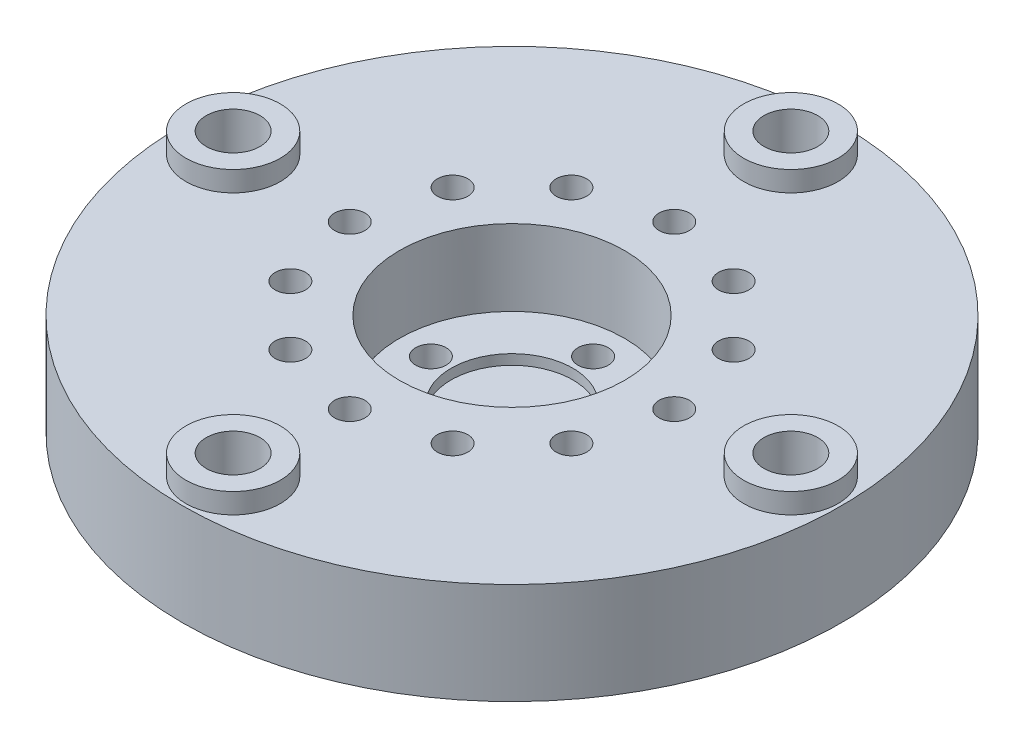
ISO-10303-21;
HEADER;
FILE_DESCRIPTION(('STEP AP214'),'2;1');
FILE_NAME('part.step','',(''),(''),'','','');
FILE_SCHEMA(('AUTOMOTIVE_DESIGN { 1 0 10303 214 1 1 1 1 }'));
ENDSEC;
DATA;
#1=APPLICATION_CONTEXT('core data for automotive mechanical design processes');
#2=APPLICATION_PROTOCOL_DEFINITION('international standard','automotive_design',2000,#1);
#3=PRODUCT_CONTEXT('',#1,'mechanical');
#4=PRODUCT('Part','Part','',(#3));
#5=PRODUCT_RELATED_PRODUCT_CATEGORY('part','',(#4));
#6=PRODUCT_DEFINITION_FORMATION('','',#4);
#7=PRODUCT_DEFINITION_CONTEXT('part definition',#1,'design');
#8=PRODUCT_DEFINITION('design','',#6,#7);
#9=PRODUCT_DEFINITION_SHAPE('','',#8);
#10=(LENGTH_UNIT() NAMED_UNIT(*) SI_UNIT(.MILLI.,.METRE.));
#11=(NAMED_UNIT(*) PLANE_ANGLE_UNIT() SI_UNIT($,.RADIAN.));
#12=(NAMED_UNIT(*) SI_UNIT($,.STERADIAN.) SOLID_ANGLE_UNIT());
#13=UNCERTAINTY_MEASURE_WITH_UNIT(LENGTH_MEASURE(1.E-05),#10,'distance_accuracy_value','');
#14=(GEOMETRIC_REPRESENTATION_CONTEXT(3) GLOBAL_UNCERTAINTY_ASSIGNED_CONTEXT((#13)) GLOBAL_UNIT_ASSIGNED_CONTEXT((#10,
#11,#12)) REPRESENTATION_CONTEXT('',''));
#15=CARTESIAN_POINT('',(0.,0.,0.));
#16=DIRECTION('',(0.,0.,1.));
#17=DIRECTION('',(1.,0.,0.));
#18=AXIS2_PLACEMENT_3D('',#15,#16,#17);
#19=CARTESIAN_POINT('',(0.,3.,0.));
#20=DIRECTION('',(0.,-1.,0.));
#21=DIRECTION('',(0.,0.,-1.));
#22=AXIS2_PLACEMENT_3D('',#19,#20,#21);
#23=CYLINDRICAL_SURFACE('',#22,11.1);
#24=CARTESIAN_POINT('',(0.,3.,0.));
#25=DIRECTION('',(0.,1.,0.));
#26=DIRECTION('',(0.,0.,1.));
#27=AXIS2_PLACEMENT_3D('',#24,#25,#26);
#28=CIRCLE('',#27,11.1);
#29=CARTESIAN_POINT('',(0.,3.,11.1));
#30=VERTEX_POINT('',#29);
#31=EDGE_CURVE('E63',#30,#30,#28,.T.);
#32=ORIENTED_EDGE('',*,*,#31,.T.);
#33=EDGE_LOOP('',(#32));
#34=FACE_BOUND('',#33,.T.);
#35=CARTESIAN_POINT('',(0.,-4.5,0.));
#36=DIRECTION('',(0.,-1.,0.));
#37=DIRECTION('',(0.,0.,-1.));
#38=AXIS2_PLACEMENT_3D('',#35,#36,#37);
#39=CIRCLE('',#38,11.1);
#40=CARTESIAN_POINT('',(0.,-4.5,-11.1));
#41=VERTEX_POINT('',#40);
#42=EDGE_CURVE('E163',#41,#41,#39,.T.);
#43=ORIENTED_EDGE('',*,*,#42,.T.);
#44=EDGE_LOOP('',(#43));
#45=FACE_BOUND('',#44,.T.);
#46=ADVANCED_FACE('F47',(#34,#45),#23,.F.);
#47=CARTESIAN_POINT('',(0.,0.,0.));
#48=DIRECTION('',(0.,1.,0.));
#49=DIRECTION('',(0.,0.,1.));
#50=AXIS2_PLACEMENT_3D('',#47,#48,#49);
#51=PLANE('',#50);
#52=CARTESIAN_POINT('',(0.,0.,-27.5));
#53=DIRECTION('',(0.,1.,0.));
#54=DIRECTION('',(0.,0.,1.));
#55=AXIS2_PLACEMENT_3D('',#52,#53,#54);
#56=CIRCLE('',#55,2.65);
#57=CARTESIAN_POINT('',(0.,0.,-24.85));
#58=VERTEX_POINT('',#57);
#59=EDGE_CURVE('E55',#58,#58,#56,.T.);
#60=ORIENTED_EDGE('',*,*,#59,.T.);
#61=EDGE_LOOP('',(#60));
#62=FACE_BOUND('',#61,.T.);
#63=CARTESIAN_POINT('',(0.,0.,-27.5));
#64=DIRECTION('',(0.,-1.,0.));
#65=DIRECTION('',(0.,0.,-1.));
#66=AXIS2_PLACEMENT_3D('',#63,#64,#65);
#67=CIRCLE('',#66,4.25);
#68=CARTESIAN_POINT('',(0.,0.,-31.75));
#69=VERTEX_POINT('',#68);
#70=EDGE_CURVE('E135',#69,#69,#67,.T.);
#71=ORIENTED_EDGE('',*,*,#70,.T.);
#72=EDGE_LOOP('',(#71));
#73=FACE_BOUND('',#72,.T.);
#74=ADVANCED_FACE('F331',(#62,#73),#51,.F.);
#75=CARTESIAN_POINT('',(-27.4999999999992,0.,7.79913119987283E-13));
#76=DIRECTION('',(0.,1.,0.));
#77=DIRECTION('',(0.,0.,1.));
#78=AXIS2_PLACEMENT_3D('',#75,#76,#77);
#79=CIRCLE('',#78,2.65000000000125);
#80=CARTESIAN_POINT('',(-27.4999999999992,0.,2.65000000000203));
#81=VERTEX_POINT('',#80);
#82=EDGE_CURVE('E80',#81,#81,#79,.T.);
#83=ORIENTED_EDGE('',*,*,#82,.T.);
#84=EDGE_LOOP('',(#83));
#85=FACE_BOUND('',#84,.T.);
#86=CARTESIAN_POINT('',(-27.5000000000008,0.,-7.76545341289627E-13));
#87=DIRECTION('',(0.,-1.,0.));
#88=DIRECTION('',(0.,0.,-1.));
#89=AXIS2_PLACEMENT_3D('',#86,#87,#88);
#90=CIRCLE('',#89,4.25000000000061);
#91=CARTESIAN_POINT('',(-27.5000000000008,0.,-4.25000000000138));
#92=VERTEX_POINT('',#91);
#93=EDGE_CURVE('E143',#92,#92,#90,.T.);
#94=ORIENTED_EDGE('',*,*,#93,.T.);
#95=EDGE_LOOP('',(#94));
#96=FACE_BOUND('',#95,.T.);
#97=ADVANCED_FACE('F336',(#85,#96),#51,.F.);
#98=CARTESIAN_POINT('',(1.55309068257925E-12,0.,27.5));
#99=DIRECTION('',(0.,1.,0.));
#100=DIRECTION('',(0.,0.,1.));
#101=AXIS2_PLACEMENT_3D('',#98,#99,#100);
#102=CIRCLE('',#101,2.65000000000167);
#103=CARTESIAN_POINT('',(1.55309068257925E-12,0.,30.1500000000017));
#104=VERTEX_POINT('',#103);
#105=EDGE_CURVE('E76',#104,#104,#102,.T.);
#106=ORIENTED_EDGE('',*,*,#105,.T.);
#107=EDGE_LOOP('',(#106));
#108=FACE_BOUND('',#107,.T.);
#109=CARTESIAN_POINT('',(-1.55309068257925E-12,0.,27.5));
#110=DIRECTION('',(0.,-1.,0.));
#111=DIRECTION('',(0.,0.,-1.));
#112=AXIS2_PLACEMENT_3D('',#109,#110,#111);
#113=CIRCLE('',#112,4.25000000000167);
#114=CARTESIAN_POINT('',(-1.55309068257925E-12,0.,23.2499999999983));
#115=VERTEX_POINT('',#114);
#116=EDGE_CURVE('E151',#115,#115,#113,.T.);
#117=ORIENTED_EDGE('',*,*,#116,.T.);
#118=EDGE_LOOP('',(#117));
#119=FACE_BOUND('',#118,.T.);
#120=ADVANCED_FACE('F353',(#108,#119),#51,.F.);
#121=CARTESIAN_POINT('',(27.5000000000008,0.,-7.76545341289627E-13));
#122=DIRECTION('',(0.,1.,0.));
#123=DIRECTION('',(0.,0.,1.));
#124=AXIS2_PLACEMENT_3D('',#121,#122,#123);
#125=CIRCLE('',#124,2.65000000000061);
#126=CARTESIAN_POINT('',(27.5000000000008,0.,2.64999999999983));
#127=VERTEX_POINT('',#126);
#128=EDGE_CURVE('E70',#127,#127,#125,.T.);
#129=ORIENTED_EDGE('',*,*,#128,.T.);
#130=EDGE_LOOP('',(#129));
#131=FACE_BOUND('',#130,.T.);
#132=CARTESIAN_POINT('',(27.4999999999992,0.,7.79913119987283E-13));
#133=DIRECTION('',(0.,-1.,0.));
#134=DIRECTION('',(0.,0.,-1.));
#135=AXIS2_PLACEMENT_3D('',#132,#133,#134);
#136=CIRCLE('',#135,4.25000000000125);
#137=CARTESIAN_POINT('',(27.4999999999992,0.,-4.25000000000047));
#138=VERTEX_POINT('',#137);
#139=EDGE_CURVE('E159',#138,#138,#136,.T.);
#140=ORIENTED_EDGE('',*,*,#139,.T.);
#141=EDGE_LOOP('',(#140));
#142=FACE_BOUND('',#141,.T.);
#143=ADVANCED_FACE('F337',(#131,#142),#51,.F.);
#144=CARTESIAN_POINT('',(0.,3.,0.));
#145=DIRECTION('',(0.,1.,0.));
#146=DIRECTION('',(0.,0.,1.));
#147=AXIS2_PLACEMENT_3D('',#144,#145,#146);
#148=PLANE('',#147);
#149=CARTESIAN_POINT('',(-13.85640646055,3.,-8.0000000000006));
#150=DIRECTION('',(0.,1.,0.));
#151=DIRECTION('',(0.,0.,1.));
#152=AXIS2_PLACEMENT_3D('',#149,#150,#151);
#153=CIRCLE('',#152,1.50000000000129);
#154=CARTESIAN_POINT('',(-13.85640646055,3.,-6.4999999999993));
#155=VERTEX_POINT('',#154);
#156=EDGE_CURVE('E199',#155,#155,#153,.T.);
#157=ORIENTED_EDGE('',*,*,#156,.F.);
#158=EDGE_LOOP('',(#157));
#159=FACE_BOUND('',#158,.T.);
#160=CARTESIAN_POINT('',(-7.99999999999873,3.,-13.8564064605514));
#161=DIRECTION('',(0.,1.,0.));
#162=DIRECTION('',(0.,0.,1.));
#163=AXIS2_PLACEMENT_3D('',#160,#161,#162);
#164=CIRCLE('',#163,1.50000000000144);
#165=CARTESIAN_POINT('',(-7.99999999999873,3.,-12.3564064605499));
#166=VERTEX_POINT('',#165);
#167=EDGE_CURVE('E206',#166,#166,#164,.T.);
#168=ORIENTED_EDGE('',*,*,#167,.F.);
#169=EDGE_LOOP('',(#168));
#170=FACE_BOUND('',#169,.T.);
#171=CARTESIAN_POINT('',(1.35836374802349E-12,3.,-16.));
#172=DIRECTION('',(0.,1.,0.));
#173=DIRECTION('',(0.,0.,1.));
#174=AXIS2_PLACEMENT_3D('',#171,#172,#173);
#175=CIRCLE('',#174,1.50000000000141);
#176=CARTESIAN_POINT('',(1.35836374802349E-12,3.,-14.4999999999986));
#177=VERTEX_POINT('',#176);
#178=EDGE_CURVE('E210',#177,#177,#175,.T.);
#179=ORIENTED_EDGE('',*,*,#178,.F.);
#180=EDGE_LOOP('',(#179));
#181=FACE_BOUND('',#180,.T.);
#182=CARTESIAN_POINT('',(8.00000000000127,3.,-13.8564064605507));
#183=DIRECTION('',(0.,1.,0.));
#184=DIRECTION('',(0.,0.,1.));
#185=AXIS2_PLACEMENT_3D('',#182,#183,#184);
#186=CIRCLE('',#185,1.50000000000121);
#187=CARTESIAN_POINT('',(8.00000000000127,3.,-12.3564064605495));
#188=VERTEX_POINT('',#187);
#189=EDGE_CURVE('E214',#188,#188,#186,.T.);
#190=ORIENTED_EDGE('',*,*,#189,.F.);
#191=EDGE_LOOP('',(#190));
#192=FACE_BOUND('',#191,.T.);
#193=CARTESIAN_POINT('',(13.856406460552,3.,-7.99999999999941));
#194=DIRECTION('',(0.,1.,0.));
#195=DIRECTION('',(0.,0.,1.));
#196=AXIS2_PLACEMENT_3D('',#193,#194,#195);
#197=CIRCLE('',#196,1.50000000000088);
#198=CARTESIAN_POINT('',(13.856406460552,3.,-6.49999999999853));
#199=VERTEX_POINT('',#198);
#200=EDGE_CURVE('E218',#199,#199,#197,.T.);
#201=ORIENTED_EDGE('',*,*,#200,.F.);
#202=EDGE_LOOP('',(#201));
#203=FACE_BOUND('',#202,.T.);
#204=CARTESIAN_POINT('',(16.0000000000007,3.,6.79181874011743E-13));
#205=DIRECTION('',(0.,1.,0.));
#206=DIRECTION('',(0.,0.,1.));
#207=AXIS2_PLACEMENT_3D('',#204,#205,#206);
#208=CIRCLE('',#207,1.50000000000051);
#209=CARTESIAN_POINT('',(16.0000000000007,3.,1.50000000000119));
#210=VERTEX_POINT('',#209);
#211=EDGE_CURVE('E222',#210,#210,#208,.T.);
#212=ORIENTED_EDGE('',*,*,#211,.F.);
#213=EDGE_LOOP('',(#212));
#214=FACE_BOUND('',#213,.T.);
#215=CARTESIAN_POINT('',(13.8564064605514,3.,8.00000000000059));
#216=DIRECTION('',(0.,1.,0.));
#217=DIRECTION('',(0.,0.,1.));
#218=AXIS2_PLACEMENT_3D('',#215,#216,#217);
#219=CIRCLE('',#218,1.50000000000019);
#220=CARTESIAN_POINT('',(13.8564064605514,3.,9.50000000000078));
#221=VERTEX_POINT('',#220);
#222=EDGE_CURVE('E226',#221,#221,#219,.T.);
#223=ORIENTED_EDGE('',*,*,#222,.F.);
#224=EDGE_LOOP('',(#223));
#225=FACE_BOUND('',#224,.T.);
#226=CARTESIAN_POINT('',(8.00000000000002,3.,13.856406460551));
#227=DIRECTION('',(0.,1.,0.));
#228=DIRECTION('',(0.,0.,1.));
#229=AXIS2_PLACEMENT_3D('',#226,#227,#228);
#230=CIRCLE('',#229,1.5);
#231=CARTESIAN_POINT('',(8.00000000000002,3.,15.356406460551));
#232=VERTEX_POINT('',#231);
#233=EDGE_CURVE('E230',#232,#232,#230,.T.);
#234=ORIENTED_EDGE('',*,*,#233,.F.);
#235=EDGE_LOOP('',(#234));
#236=FACE_BOUND('',#235,.T.);
#237=CARTESIAN_POINT('',(-15.9999999999993,3.,-6.81141308890378E-13));
#238=DIRECTION('',(0.,1.,0.));
#239=DIRECTION('',(0.,0.,1.));
#240=AXIS2_PLACEMENT_3D('',#237,#238,#239);
#241=CIRCLE('',#240,1.50000000000101);
#242=CARTESIAN_POINT('',(-15.9999999999993,3.,1.50000000000033));
#243=VERTEX_POINT('',#242);
#244=EDGE_CURVE('E234',#243,#243,#241,.T.);
#245=ORIENTED_EDGE('',*,*,#244,.F.);
#246=EDGE_LOOP('',(#245));
#247=FACE_BOUND('',#246,.T.);
#248=CARTESIAN_POINT('',(-13.8564064605507,3.,7.9999999999994));
#249=DIRECTION('',(0.,1.,0.));
#250=DIRECTION('',(0.,0.,1.));
#251=AXIS2_PLACEMENT_3D('',#248,#249,#250);
#252=CIRCLE('',#251,1.50000000000069);
#253=CARTESIAN_POINT('',(-13.8564064605507,3.,9.50000000000009));
#254=VERTEX_POINT('',#253);
#255=EDGE_CURVE('E238',#254,#254,#252,.T.);
#256=ORIENTED_EDGE('',*,*,#255,.F.);
#257=EDGE_LOOP('',(#256));
#258=FACE_BOUND('',#257,.T.);
#259=CARTESIAN_POINT('',(-7.99999999999992,3.,13.8564064605507));
#260=DIRECTION('',(0.,1.,0.));
#261=DIRECTION('',(0.,0.,1.));
#262=AXIS2_PLACEMENT_3D('',#259,#260,#261);
#263=CIRCLE('',#262,1.50000000000039);
#264=CARTESIAN_POINT('',(-7.99999999999992,3.,15.3564064605511));
#265=VERTEX_POINT('',#264);
#266=EDGE_CURVE('E242',#265,#265,#263,.T.);
#267=ORIENTED_EDGE('',*,*,#266,.F.);
#268=EDGE_LOOP('',(#267));
#269=FACE_BOUND('',#268,.T.);
#270=CARTESIAN_POINT('',(0.,3.,16.));
#271=DIRECTION('',(0.,1.,0.));
#272=DIRECTION('',(0.,0.,1.));
#273=AXIS2_PLACEMENT_3D('',#270,#271,#272);
#274=CIRCLE('',#273,1.5);
#275=CARTESIAN_POINT('',(0.,3.,17.5));
#276=VERTEX_POINT('',#275);
#277=EDGE_CURVE('E246',#276,#276,#274,.T.);
#278=ORIENTED_EDGE('',*,*,#277,.F.);
#279=EDGE_LOOP('',(#278));
#280=FACE_BOUND('',#279,.T.);
#281=CARTESIAN_POINT('',(0.,3.,-27.5));
#282=DIRECTION('',(0.,1.,0.));
#283=DIRECTION('',(0.,0.,1.));
#284=AXIS2_PLACEMENT_3D('',#281,#282,#283);
#285=CIRCLE('',#284,4.65);
#286=CARTESIAN_POINT('',(0.,3.,-22.85));
#287=VERTEX_POINT('',#286);
#288=EDGE_CURVE('E111',#287,#287,#285,.T.);
#289=ORIENTED_EDGE('',*,*,#288,.F.);
#290=EDGE_LOOP('',(#289));
#291=FACE_BOUND('',#290,.T.);
#292=CARTESIAN_POINT('',(1.55309068257925E-12,3.,27.5));
#293=DIRECTION('',(0.,1.,0.));
#294=DIRECTION('',(0.,0.,1.));
#295=AXIS2_PLACEMENT_3D('',#292,#293,#294);
#296=CIRCLE('',#295,4.65000000000167);
#297=CARTESIAN_POINT('',(1.55309068257925E-12,3.,32.1500000000017));
#298=VERTEX_POINT('',#297);
#299=EDGE_CURVE('E85',#298,#298,#296,.T.);
#300=ORIENTED_EDGE('',*,*,#299,.F.);
#301=EDGE_LOOP('',(#300));
#302=FACE_BOUND('',#301,.T.);
#303=ORIENTED_EDGE('',*,*,#31,.F.);
#304=EDGE_LOOP('',(#303));
#305=FACE_BOUND('',#304,.T.);
#306=CARTESIAN_POINT('',(0.,3.,0.));
#307=DIRECTION('',(0.,1.,0.));
#308=DIRECTION('',(0.,0.,1.));
#309=AXIS2_PLACEMENT_3D('',#306,#307,#308);
#310=CIRCLE('',#309,32.5);
#311=CARTESIAN_POINT('',(0.,3.,32.5));
#312=VERTEX_POINT('',#311);
#313=EDGE_CURVE('E10',#312,#312,#310,.T.);
#314=ORIENTED_EDGE('',*,*,#313,.T.);
#315=EDGE_LOOP('',(#314));
#316=FACE_BOUND('',#315,.T.);
#317=CARTESIAN_POINT('',(27.5000000000008,3.,-7.76545341289627E-13));
#318=DIRECTION('',(0.,1.,0.));
#319=DIRECTION('',(0.,0.,1.));
#320=AXIS2_PLACEMENT_3D('',#317,#318,#319);
#321=CIRCLE('',#320,4.65000000000061);
#322=CARTESIAN_POINT('',(27.5000000000008,3.,4.64999999999983));
#323=VERTEX_POINT('',#322);
#324=EDGE_CURVE('E99',#323,#323,#321,.T.);
#325=ORIENTED_EDGE('',*,*,#324,.F.);
#326=EDGE_LOOP('',(#325));
#327=FACE_BOUND('',#326,.T.);
#328=CARTESIAN_POINT('',(-27.4999999999992,3.,7.79913119987283E-13));
#329=DIRECTION('',(0.,1.,0.));
#330=DIRECTION('',(0.,0.,1.));
#331=AXIS2_PLACEMENT_3D('',#328,#329,#330);
#332=CIRCLE('',#331,4.65000000000125);
#333=CARTESIAN_POINT('',(-27.4999999999992,3.,4.65000000000203));
#334=VERTEX_POINT('',#333);
#335=EDGE_CURVE('E122',#334,#334,#332,.T.);
#336=ORIENTED_EDGE('',*,*,#335,.F.);
#337=EDGE_LOOP('',(#336));
#338=FACE_BOUND('',#337,.T.);
#339=ADVANCED_FACE('F346',(#159,#170,#181,#192,#203,#214,#225,#236,#247,#258,#269,#280,#291,
#302,#305,#316,#327,#338),#148,.T.);
#340=CARTESIAN_POINT('',(0.,3.,0.));
#341=DIRECTION('',(0.,-1.,0.));
#342=DIRECTION('',(0.,0.,-1.));
#343=AXIS2_PLACEMENT_3D('',#340,#341,#342);
#344=CYLINDRICAL_SURFACE('',#343,32.5);
#345=ORIENTED_EDGE('',*,*,#313,.F.);
#346=EDGE_LOOP('',(#345));
#347=FACE_BOUND('',#346,.T.);
#348=CARTESIAN_POINT('',(0.,-7.,0.));
#349=DIRECTION('',(0.,-1.,0.));
#350=DIRECTION('',(0.,0.,-1.));
#351=AXIS2_PLACEMENT_3D('',#348,#349,#350);
#352=CIRCLE('',#351,32.5);
#353=CARTESIAN_POINT('',(0.,-7.,-32.5));
#354=VERTEX_POINT('',#353);
#355=EDGE_CURVE('E127',#354,#354,#352,.T.);
#356=ORIENTED_EDGE('',*,*,#355,.F.);
#357=EDGE_LOOP('',(#356));
#358=FACE_BOUND('',#357,.T.);
#359=ADVANCED_FACE('F49',(#347,#358),#344,.T.);
#360=CARTESIAN_POINT('',(0.,3.,-27.5));
#361=DIRECTION('',(0.,-1.,0.));
#362=DIRECTION('',(0.,0.,-1.));
#363=AXIS2_PLACEMENT_3D('',#360,#361,#362);
#364=CYLINDRICAL_SURFACE('',#363,2.65);
#365=ORIENTED_EDGE('',*,*,#59,.F.);
#366=EDGE_LOOP('',(#365));
#367=FACE_BOUND('',#366,.T.);
#368=CARTESIAN_POINT('',(0.,5.,-27.5));
#369=DIRECTION('',(0.,1.,0.));
#370=DIRECTION('',(0.,0.,1.));
#371=AXIS2_PLACEMENT_3D('',#368,#369,#370);
#372=CIRCLE('',#371,2.65);
#373=CARTESIAN_POINT('',(0.,5.,-24.85));
#374=VERTEX_POINT('',#373);
#375=EDGE_CURVE('E104',#374,#374,#372,.T.);
#376=ORIENTED_EDGE('',*,*,#375,.T.);
#377=EDGE_LOOP('',(#376));
#378=FACE_BOUND('',#377,.T.);
#379=ADVANCED_FACE('F342',(#367,#378),#364,.F.);
#380=CARTESIAN_POINT('',(27.5000000000008,3.,-7.76545341289627E-13));
#381=DIRECTION('',(0.,-1.,0.));
#382=DIRECTION('',(0.,0.,-1.));
#383=AXIS2_PLACEMENT_3D('',#380,#381,#382);
#384=CYLINDRICAL_SURFACE('',#383,2.65000000000061);
#385=ORIENTED_EDGE('',*,*,#128,.F.);
#386=EDGE_LOOP('',(#385));
#387=FACE_BOUND('',#386,.T.);
#388=CARTESIAN_POINT('',(27.5000000000008,5.,-7.76545341289627E-13));
#389=DIRECTION('',(0.,1.,0.));
#390=DIRECTION('',(0.,0.,1.));
#391=AXIS2_PLACEMENT_3D('',#388,#389,#390);
#392=CIRCLE('',#391,2.65000000000061);
#393=CARTESIAN_POINT('',(27.5000000000008,5.,2.64999999999983));
#394=VERTEX_POINT('',#393);
#395=EDGE_CURVE('E95',#394,#394,#392,.T.);
#396=ORIENTED_EDGE('',*,*,#395,.T.);
#397=EDGE_LOOP('',(#396));
#398=FACE_BOUND('',#397,.T.);
#399=ADVANCED_FACE('F340',(#387,#398),#384,.F.);
#400=CARTESIAN_POINT('',(1.55309068257925E-12,3.,27.5));
#401=DIRECTION('',(0.,-1.,0.));
#402=DIRECTION('',(0.,0.,-1.));
#403=AXIS2_PLACEMENT_3D('',#400,#401,#402);
#404=CYLINDRICAL_SURFACE('',#403,2.65000000000167);
#405=ORIENTED_EDGE('',*,*,#105,.F.);
#406=EDGE_LOOP('',(#405));
#407=FACE_BOUND('',#406,.T.);
#408=CARTESIAN_POINT('',(1.55309068257925E-12,5.,27.5));
#409=DIRECTION('',(0.,1.,0.));
#410=DIRECTION('',(0.,0.,1.));
#411=AXIS2_PLACEMENT_3D('',#408,#409,#410);
#412=CIRCLE('',#411,2.65000000000167);
#413=CARTESIAN_POINT('',(1.55309068257925E-12,5.,30.1500000000017));
#414=VERTEX_POINT('',#413);
#415=EDGE_CURVE('E88',#414,#414,#412,.T.);
#416=ORIENTED_EDGE('',*,*,#415,.T.);
#417=EDGE_LOOP('',(#416));
#418=FACE_BOUND('',#417,.T.);
#419=ADVANCED_FACE('F432',(#407,#418),#404,.F.);
#420=CARTESIAN_POINT('',(-27.4999999999992,3.,7.79913119987283E-13));
#421=DIRECTION('',(0.,-1.,0.));
#422=DIRECTION('',(0.,0.,-1.));
#423=AXIS2_PLACEMENT_3D('',#420,#421,#422);
#424=CYLINDRICAL_SURFACE('',#423,2.65000000000125);
#425=ORIENTED_EDGE('',*,*,#82,.F.);
#426=EDGE_LOOP('',(#425));
#427=FACE_BOUND('',#426,.T.);
#428=CARTESIAN_POINT('',(-27.4999999999992,5.,7.79913119987283E-13));
#429=DIRECTION('',(0.,1.,0.));
#430=DIRECTION('',(0.,0.,1.));
#431=AXIS2_PLACEMENT_3D('',#428,#429,#430);
#432=CIRCLE('',#431,2.65000000000125);
#433=CARTESIAN_POINT('',(-27.4999999999992,5.,2.65000000000203));
#434=VERTEX_POINT('',#433);
#435=EDGE_CURVE('E116',#434,#434,#432,.T.);
#436=ORIENTED_EDGE('',*,*,#435,.T.);
#437=EDGE_LOOP('',(#436));
#438=FACE_BOUND('',#437,.T.);
#439=ADVANCED_FACE('F426',(#427,#438),#424,.F.);
#440=CARTESIAN_POINT('',(1.55309068257925E-12,5.,27.5));
#441=DIRECTION('',(0.,1.,0.));
#442=DIRECTION('',(0.,0.,1.));
#443=AXIS2_PLACEMENT_3D('',#440,#441,#442);
#444=PLANE('',#443);
#445=CARTESIAN_POINT('',(1.55309068257925E-12,5.,27.5));
#446=DIRECTION('',(0.,1.,0.));
#447=DIRECTION('',(0.,0.,1.));
#448=AXIS2_PLACEMENT_3D('',#445,#446,#447);
#449=CIRCLE('',#448,4.65000000000167);
#450=CARTESIAN_POINT('',(1.55309068257925E-12,5.,32.1500000000017));
#451=VERTEX_POINT('',#450);
#452=EDGE_CURVE('E84',#451,#451,#449,.T.);
#453=ORIENTED_EDGE('',*,*,#452,.T.);
#454=EDGE_LOOP('',(#453));
#455=FACE_BOUND('',#454,.T.);
#456=ORIENTED_EDGE('',*,*,#415,.F.);
#457=EDGE_LOOP('',(#456));
#458=FACE_BOUND('',#457,.T.);
#459=ADVANCED_FACE('F423',(#455,#458),#444,.T.);
#460=CARTESIAN_POINT('',(1.55309068257925E-12,5.,27.5));
#461=DIRECTION('',(0.,-1.,0.));
#462=DIRECTION('',(0.,0.,-1.));
#463=AXIS2_PLACEMENT_3D('',#460,#461,#462);
#464=CYLINDRICAL_SURFACE('',#463,4.65000000000167);
#465=ORIENTED_EDGE('',*,*,#452,.F.);
#466=EDGE_LOOP('',(#465));
#467=FACE_BOUND('',#466,.T.);
#468=ORIENTED_EDGE('',*,*,#299,.T.);
#469=EDGE_LOOP('',(#468));
#470=FACE_BOUND('',#469,.T.);
#471=ADVANCED_FACE('F421',(#467,#470),#464,.T.);
#472=CARTESIAN_POINT('',(27.5000000000008,5.,-7.76545341289627E-13));
#473=DIRECTION('',(0.,1.,0.));
#474=DIRECTION('',(0.,0.,1.));
#475=AXIS2_PLACEMENT_3D('',#472,#473,#474);
#476=PLANE('',#475);
#477=CARTESIAN_POINT('',(27.5000000000008,5.,-7.76545341289627E-13));
#478=DIRECTION('',(0.,1.,0.));
#479=DIRECTION('',(0.,0.,1.));
#480=AXIS2_PLACEMENT_3D('',#477,#478,#479);
#481=CIRCLE('',#480,4.65000000000061);
#482=CARTESIAN_POINT('',(27.5000000000008,5.,4.64999999999983));
#483=VERTEX_POINT('',#482);
#484=EDGE_CURVE('E100',#483,#483,#481,.T.);
#485=ORIENTED_EDGE('',*,*,#484,.T.);
#486=EDGE_LOOP('',(#485));
#487=FACE_BOUND('',#486,.T.);
#488=ORIENTED_EDGE('',*,*,#395,.F.);
#489=EDGE_LOOP('',(#488));
#490=FACE_BOUND('',#489,.T.);
#491=ADVANCED_FACE('F417',(#487,#490),#476,.T.);
#492=CARTESIAN_POINT('',(27.5000000000008,5.,-7.76545341289627E-13));
#493=DIRECTION('',(0.,-1.,0.));
#494=DIRECTION('',(0.,0.,-1.));
#495=AXIS2_PLACEMENT_3D('',#492,#493,#494);
#496=CYLINDRICAL_SURFACE('',#495,4.65000000000061);
#497=ORIENTED_EDGE('',*,*,#484,.F.);
#498=EDGE_LOOP('',(#497));
#499=FACE_BOUND('',#498,.T.);
#500=ORIENTED_EDGE('',*,*,#324,.T.);
#501=EDGE_LOOP('',(#500));
#502=FACE_BOUND('',#501,.T.);
#503=ADVANCED_FACE('F413',(#499,#502),#496,.T.);
#504=CARTESIAN_POINT('',(0.,5.,-27.5));
#505=DIRECTION('',(0.,1.,0.));
#506=DIRECTION('',(0.,0.,1.));
#507=AXIS2_PLACEMENT_3D('',#504,#505,#506);
#508=PLANE('',#507);
#509=CARTESIAN_POINT('',(0.,5.,-27.5));
#510=DIRECTION('',(0.,1.,0.));
#511=DIRECTION('',(0.,0.,1.));
#512=AXIS2_PLACEMENT_3D('',#509,#510,#511);
#513=CIRCLE('',#512,4.65);
#514=CARTESIAN_POINT('',(0.,5.,-22.85));
#515=VERTEX_POINT('',#514);
#516=EDGE_CURVE('E112',#515,#515,#513,.T.);
#517=ORIENTED_EDGE('',*,*,#516,.T.);
#518=EDGE_LOOP('',(#517));
#519=FACE_BOUND('',#518,.T.);
#520=ORIENTED_EDGE('',*,*,#375,.F.);
#521=EDGE_LOOP('',(#520));
#522=FACE_BOUND('',#521,.T.);
#523=ADVANCED_FACE('F409',(#519,#522),#508,.T.);
#524=CARTESIAN_POINT('',(0.,5.,-27.5));
#525=DIRECTION('',(0.,-1.,0.));
#526=DIRECTION('',(0.,0.,-1.));
#527=AXIS2_PLACEMENT_3D('',#524,#525,#526);
#528=CYLINDRICAL_SURFACE('',#527,4.65);
#529=ORIENTED_EDGE('',*,*,#516,.F.);
#530=EDGE_LOOP('',(#529));
#531=FACE_BOUND('',#530,.T.);
#532=ORIENTED_EDGE('',*,*,#288,.T.);
#533=EDGE_LOOP('',(#532));
#534=FACE_BOUND('',#533,.T.);
#535=ADVANCED_FACE('F401',(#531,#534),#528,.T.);
#536=CARTESIAN_POINT('',(-27.4999999999992,5.,7.79913119987283E-13));
#537=DIRECTION('',(0.,1.,0.));
#538=DIRECTION('',(0.,0.,1.));
#539=AXIS2_PLACEMENT_3D('',#536,#537,#538);
#540=PLANE('',#539);
#541=CARTESIAN_POINT('',(-27.4999999999992,5.,7.79913119987283E-13));
#542=DIRECTION('',(0.,1.,0.));
#543=DIRECTION('',(0.,0.,1.));
#544=AXIS2_PLACEMENT_3D('',#541,#542,#543);
#545=CIRCLE('',#544,4.65000000000125);
#546=CARTESIAN_POINT('',(-27.4999999999992,5.,4.65000000000203));
#547=VERTEX_POINT('',#546);
#548=EDGE_CURVE('E123',#547,#547,#545,.T.);
#549=ORIENTED_EDGE('',*,*,#548,.T.);
#550=EDGE_LOOP('',(#549));
#551=FACE_BOUND('',#550,.T.);
#552=ORIENTED_EDGE('',*,*,#435,.F.);
#553=EDGE_LOOP('',(#552));
#554=FACE_BOUND('',#553,.T.);
#555=ADVANCED_FACE('F392',(#551,#554),#540,.T.);
#556=CARTESIAN_POINT('',(-27.4999999999992,5.,7.79913119987283E-13));
#557=DIRECTION('',(0.,-1.,0.));
#558=DIRECTION('',(0.,0.,-1.));
#559=AXIS2_PLACEMENT_3D('',#556,#557,#558);
#560=CYLINDRICAL_SURFACE('',#559,4.65000000000125);
#561=ORIENTED_EDGE('',*,*,#548,.F.);
#562=EDGE_LOOP('',(#561));
#563=FACE_BOUND('',#562,.T.);
#564=ORIENTED_EDGE('',*,*,#335,.T.);
#565=EDGE_LOOP('',(#564));
#566=FACE_BOUND('',#565,.T.);
#567=ADVANCED_FACE('F389',(#563,#566),#560,.T.);
#568=CARTESIAN_POINT('',(0.,-7.,0.));
#569=DIRECTION('',(0.,-1.,0.));
#570=DIRECTION('',(0.,0.,-1.));
#571=AXIS2_PLACEMENT_3D('',#568,#569,#570);
#572=PLANE('',#571);
#573=CARTESIAN_POINT('',(-13.85640646055,-7.,-8.0000000000006));
#574=DIRECTION('',(0.,-1.,0.));
#575=DIRECTION('',(0.,0.,-1.));
#576=AXIS2_PLACEMENT_3D('',#573,#574,#575);
#577=CIRCLE('',#576,1.50000000000129);
#578=CARTESIAN_POINT('',(-13.85640646055,-7.,-9.50000000000189));
#579=VERTEX_POINT('',#578);
#580=EDGE_CURVE('E269',#579,#579,#577,.T.);
#581=ORIENTED_EDGE('',*,*,#580,.F.);
#582=EDGE_LOOP('',(#581));
#583=FACE_BOUND('',#582,.T.);
#584=CARTESIAN_POINT('',(-7.99999999999873,-7.,-13.8564064605514));
#585=DIRECTION('',(0.,-1.,0.));
#586=DIRECTION('',(0.,0.,-1.));
#587=AXIS2_PLACEMENT_3D('',#584,#585,#586);
#588=CIRCLE('',#587,1.50000000000144);
#589=CARTESIAN_POINT('',(-7.99999999999873,-7.,-15.3564064605528));
#590=VERTEX_POINT('',#589);
#591=EDGE_CURVE('E273',#590,#590,#588,.T.);
#592=ORIENTED_EDGE('',*,*,#591,.F.);
#593=EDGE_LOOP('',(#592));
#594=FACE_BOUND('',#593,.T.);
#595=CARTESIAN_POINT('',(1.35836374802349E-12,-7.,-16.));
#596=DIRECTION('',(0.,-1.,0.));
#597=DIRECTION('',(0.,0.,-1.));
#598=AXIS2_PLACEMENT_3D('',#595,#596,#597);
#599=CIRCLE('',#598,1.50000000000141);
#600=CARTESIAN_POINT('',(1.35836374802349E-12,-7.,-17.5000000000014));
#601=VERTEX_POINT('',#600);
#602=EDGE_CURVE('E278',#601,#601,#599,.T.);
#603=ORIENTED_EDGE('',*,*,#602,.F.);
#604=EDGE_LOOP('',(#603));
#605=FACE_BOUND('',#604,.T.);
#606=CARTESIAN_POINT('',(8.00000000000127,-7.,-13.8564064605507));
#607=DIRECTION('',(0.,-1.,0.));
#608=DIRECTION('',(0.,0.,-1.));
#609=AXIS2_PLACEMENT_3D('',#606,#607,#608);
#610=CIRCLE('',#609,1.50000000000121);
#611=CARTESIAN_POINT('',(8.00000000000127,-7.,-15.3564064605519));
#612=VERTEX_POINT('',#611);
#613=EDGE_CURVE('E258',#612,#612,#610,.T.);
#614=ORIENTED_EDGE('',*,*,#613,.F.);
#615=EDGE_LOOP('',(#614));
#616=FACE_BOUND('',#615,.T.);
#617=CARTESIAN_POINT('',(13.856406460552,-7.,-7.99999999999941));
#618=DIRECTION('',(0.,-1.,0.));
#619=DIRECTION('',(0.,0.,-1.));
#620=AXIS2_PLACEMENT_3D('',#617,#618,#619);
#621=CIRCLE('',#620,1.50000000000088);
#622=CARTESIAN_POINT('',(13.856406460552,-7.,-9.50000000000029));
#623=VERTEX_POINT('',#622);
#624=EDGE_CURVE('E254',#623,#623,#621,.T.);
#625=ORIENTED_EDGE('',*,*,#624,.F.);
#626=EDGE_LOOP('',(#625));
#627=FACE_BOUND('',#626,.T.);
#628=CARTESIAN_POINT('',(16.0000000000007,-7.,6.79181874011743E-13));
#629=DIRECTION('',(0.,-1.,0.));
#630=DIRECTION('',(0.,0.,-1.));
#631=AXIS2_PLACEMENT_3D('',#628,#629,#630);
#632=CIRCLE('',#631,1.50000000000051);
#633=CARTESIAN_POINT('',(16.0000000000007,-7.,-1.49999999999983));
#634=VERTEX_POINT('',#633);
#635=EDGE_CURVE('E257',#634,#634,#632,.T.);
#636=ORIENTED_EDGE('',*,*,#635,.F.);
#637=EDGE_LOOP('',(#636));
#638=FACE_BOUND('',#637,.T.);
#639=CARTESIAN_POINT('',(13.8564064605514,-7.,8.00000000000059));
#640=DIRECTION('',(0.,-1.,0.));
#641=DIRECTION('',(0.,0.,-1.));
#642=AXIS2_PLACEMENT_3D('',#639,#640,#641);
#643=CIRCLE('',#642,1.50000000000019);
#644=CARTESIAN_POINT('',(13.8564064605514,-7.,6.5000000000004));
#645=VERTEX_POINT('',#644);
#646=EDGE_CURVE('E262',#645,#645,#643,.T.);
#647=ORIENTED_EDGE('',*,*,#646,.F.);
#648=EDGE_LOOP('',(#647));
#649=FACE_BOUND('',#648,.T.);
#650=CARTESIAN_POINT('',(8.00000000000002,-7.,13.856406460551));
#651=DIRECTION('',(0.,-1.,0.));
#652=DIRECTION('',(0.,0.,-1.));
#653=AXIS2_PLACEMENT_3D('',#650,#651,#652);
#654=CIRCLE('',#653,1.5);
#655=CARTESIAN_POINT('',(8.00000000000002,-7.,12.356406460551));
#656=VERTEX_POINT('',#655);
#657=EDGE_CURVE('E253',#656,#656,#654,.T.);
#658=ORIENTED_EDGE('',*,*,#657,.F.);
#659=EDGE_LOOP('',(#658));
#660=FACE_BOUND('',#659,.T.);
#661=CARTESIAN_POINT('',(-15.9999999999993,-7.,-6.81141308890378E-13));
#662=DIRECTION('',(0.,-1.,0.));
#663=DIRECTION('',(0.,0.,-1.));
#664=AXIS2_PLACEMENT_3D('',#661,#662,#663);
#665=CIRCLE('',#664,1.50000000000101);
#666=CARTESIAN_POINT('',(-15.9999999999993,-7.,-1.50000000000169));
#667=VERTEX_POINT('',#666);
#668=EDGE_CURVE('E274',#667,#667,#665,.T.);
#669=ORIENTED_EDGE('',*,*,#668,.F.);
#670=EDGE_LOOP('',(#669));
#671=FACE_BOUND('',#670,.T.);
#672=CARTESIAN_POINT('',(-13.8564064605507,-7.,7.9999999999994));
#673=DIRECTION('',(0.,-1.,0.));
#674=DIRECTION('',(0.,0.,-1.));
#675=AXIS2_PLACEMENT_3D('',#672,#673,#674);
#676=CIRCLE('',#675,1.50000000000069);
#677=CARTESIAN_POINT('',(-13.8564064605507,-7.,6.49999999999871));
#678=VERTEX_POINT('',#677);
#679=EDGE_CURVE('E289',#678,#678,#676,.T.);
#680=ORIENTED_EDGE('',*,*,#679,.F.);
#681=EDGE_LOOP('',(#680));
#682=FACE_BOUND('',#681,.T.);
#683=CARTESIAN_POINT('',(-7.99999999999992,-7.,13.8564064605507));
#684=DIRECTION('',(0.,-1.,0.));
#685=DIRECTION('',(0.,0.,-1.));
#686=AXIS2_PLACEMENT_3D('',#683,#684,#685);
#687=CIRCLE('',#686,1.50000000000039);
#688=CARTESIAN_POINT('',(-7.99999999999992,-7.,12.3564064605503));
#689=VERTEX_POINT('',#688);
#690=EDGE_CURVE('E285',#689,#689,#687,.T.);
#691=ORIENTED_EDGE('',*,*,#690,.F.);
#692=EDGE_LOOP('',(#691));
#693=FACE_BOUND('',#692,.T.);
#694=CARTESIAN_POINT('',(0.,-7.,16.));
#695=DIRECTION('',(0.,-1.,0.));
#696=DIRECTION('',(0.,0.,-1.));
#697=AXIS2_PLACEMENT_3D('',#694,#695,#696);
#698=CIRCLE('',#697,1.5);
#699=CARTESIAN_POINT('',(0.,-7.,14.5));
#700=VERTEX_POINT('',#699);
#701=EDGE_CURVE('E250',#700,#700,#698,.T.);
#702=ORIENTED_EDGE('',*,*,#701,.F.);
#703=EDGE_LOOP('',(#702));
#704=FACE_BOUND('',#703,.T.);
#705=CARTESIAN_POINT('',(-1.55309068257925E-12,-7.,27.5));
#706=DIRECTION('',(0.,-1.,0.));
#707=DIRECTION('',(0.,0.,-1.));
#708=AXIS2_PLACEMENT_3D('',#705,#706,#707);
#709=CIRCLE('',#708,4.25000000000167);
#710=CARTESIAN_POINT('',(-1.55309068257925E-12,-7.,23.2499999999983));
#711=VERTEX_POINT('',#710);
#712=EDGE_CURVE('E147',#711,#711,#709,.T.);
#713=ORIENTED_EDGE('',*,*,#712,.F.);
#714=EDGE_LOOP('',(#713));
#715=FACE_BOUND('',#714,.T.);
#716=CARTESIAN_POINT('',(0.,-7.,-27.5));
#717=DIRECTION('',(0.,-1.,0.));
#718=DIRECTION('',(0.,0.,-1.));
#719=AXIS2_PLACEMENT_3D('',#716,#717,#718);
#720=CIRCLE('',#719,4.25);
#721=CARTESIAN_POINT('',(0.,-7.,-31.75));
#722=VERTEX_POINT('',#721);
#723=EDGE_CURVE('E134',#722,#722,#720,.T.);
#724=ORIENTED_EDGE('',*,*,#723,.F.);
#725=EDGE_LOOP('',(#724));
#726=FACE_BOUND('',#725,.T.);
#727=ORIENTED_EDGE('',*,*,#355,.T.);
#728=EDGE_LOOP('',(#727));
#729=FACE_BOUND('',#728,.T.);
#730=CARTESIAN_POINT('',(-27.5000000000008,-7.,-7.76545341289627E-13));
#731=DIRECTION('',(0.,-1.,0.));
#732=DIRECTION('',(0.,0.,-1.));
#733=AXIS2_PLACEMENT_3D('',#730,#731,#732);
#734=CIRCLE('',#733,4.25000000000061);
#735=CARTESIAN_POINT('',(-27.5000000000008,-7.,-4.25000000000138));
#736=VERTEX_POINT('',#735);
#737=EDGE_CURVE('E139',#736,#736,#734,.T.);
#738=ORIENTED_EDGE('',*,*,#737,.F.);
#739=EDGE_LOOP('',(#738));
#740=FACE_BOUND('',#739,.T.);
#741=CARTESIAN_POINT('',(27.4999999999992,-7.,7.79913119987283E-13));
#742=DIRECTION('',(0.,-1.,0.));
#743=DIRECTION('',(0.,0.,-1.));
#744=AXIS2_PLACEMENT_3D('',#741,#742,#743);
#745=CIRCLE('',#744,4.25000000000125);
#746=CARTESIAN_POINT('',(27.4999999999992,-7.,-4.25000000000047));
#747=VERTEX_POINT('',#746);
#748=EDGE_CURVE('E155',#747,#747,#745,.T.);
#749=ORIENTED_EDGE('',*,*,#748,.F.);
#750=EDGE_LOOP('',(#749));
#751=FACE_BOUND('',#750,.T.);
#752=CARTESIAN_POINT('',(7.99999999999977,-7.,2.26883816723573E-13));
#753=DIRECTION('',(0.,-1.,0.));
#754=DIRECTION('',(0.,0.,-1.));
#755=AXIS2_PLACEMENT_3D('',#752,#753,#754);
#756=CIRCLE('',#755,1.50000000000036);
#757=CARTESIAN_POINT('',(7.99999999999977,-7.,-1.50000000000014));
#758=VERTEX_POINT('',#757);
#759=EDGE_CURVE('E195',#758,#758,#756,.T.);
#760=ORIENTED_EDGE('',*,*,#759,.F.);
#761=EDGE_LOOP('',(#760));
#762=FACE_BOUND('',#761,.T.);
#763=CARTESIAN_POINT('',(-4.51808198568511E-13,-7.,8.));
#764=DIRECTION('',(0.,-1.,0.));
#765=DIRECTION('',(0.,0.,-1.));
#766=AXIS2_PLACEMENT_3D('',#763,#764,#765);
#767=CIRCLE('',#766,1.50000000000049);
#768=CARTESIAN_POINT('',(-4.51808198568511E-13,-7.,6.49999999999952));
#769=VERTEX_POINT('',#768);
#770=EDGE_CURVE('E187',#769,#769,#767,.T.);
#771=ORIENTED_EDGE('',*,*,#770,.F.);
#772=EDGE_LOOP('',(#771));
#773=FACE_BOUND('',#772,.T.);
#774=CARTESIAN_POINT('',(-8.00000000000023,-7.,-2.25904099284255E-13));
#775=DIRECTION('',(0.,-1.,0.));
#776=DIRECTION('',(0.,0.,-1.));
#777=AXIS2_PLACEMENT_3D('',#774,#775,#776);
#778=CIRCLE('',#777,1.50000000000018);
#779=CARTESIAN_POINT('',(-8.00000000000023,-7.,-1.5000000000004));
#780=VERTEX_POINT('',#779);
#781=EDGE_CURVE('E179',#780,#780,#778,.T.);
#782=ORIENTED_EDGE('',*,*,#781,.F.);
#783=EDGE_LOOP('',(#782));
#784=FACE_BOUND('',#783,.T.);
#785=CARTESIAN_POINT('',(0.,-7.,-8.));
#786=DIRECTION('',(0.,-1.,0.));
#787=DIRECTION('',(0.,0.,-1.));
#788=AXIS2_PLACEMENT_3D('',#785,#786,#787);
#789=CIRCLE('',#788,1.5);
#790=CARTESIAN_POINT('',(0.,-7.,-9.5));
#791=VERTEX_POINT('',#790);
#792=EDGE_CURVE('E171',#791,#791,#789,.T.);
#793=ORIENTED_EDGE('',*,*,#792,.F.);
#794=EDGE_LOOP('',(#793));
#795=FACE_BOUND('',#794,.T.);
#796=ADVANCED_FACE('F391',(#583,#594,#605,#616,#627,#638,#649,#660,#671,#682,#693,#704,#715,
#726,#729,#740,#751,#762,#773,#784,#795),#572,.T.);
#797=CARTESIAN_POINT('',(0.,-7.,-27.5));
#798=DIRECTION('',(0.,1.,0.));
#799=DIRECTION('',(0.,0.,1.));
#800=AXIS2_PLACEMENT_3D('',#797,#798,#799);
#801=CYLINDRICAL_SURFACE('',#800,4.25);
#802=ORIENTED_EDGE('',*,*,#723,.T.);
#803=EDGE_LOOP('',(#802));
#804=FACE_BOUND('',#803,.T.);
#805=ORIENTED_EDGE('',*,*,#70,.F.);
#806=EDGE_LOOP('',(#805));
#807=FACE_BOUND('',#806,.T.);
#808=ADVANCED_FACE('F398',(#804,#807),#801,.F.);
#809=CARTESIAN_POINT('',(-27.5000000000008,-7.,-7.76545341289627E-13));
#810=DIRECTION('',(0.,1.,0.));
#811=DIRECTION('',(0.,0.,1.));
#812=AXIS2_PLACEMENT_3D('',#809,#810,#811);
#813=CYLINDRICAL_SURFACE('',#812,4.25000000000061);
#814=ORIENTED_EDGE('',*,*,#737,.T.);
#815=EDGE_LOOP('',(#814));
#816=FACE_BOUND('',#815,.T.);
#817=ORIENTED_EDGE('',*,*,#93,.F.);
#818=EDGE_LOOP('',(#817));
#819=FACE_BOUND('',#818,.T.);
#820=ADVANCED_FACE('F450',(#816,#819),#813,.F.);
#821=CARTESIAN_POINT('',(-1.55309068257925E-12,-7.,27.5));
#822=DIRECTION('',(0.,1.,0.));
#823=DIRECTION('',(0.,0.,1.));
#824=AXIS2_PLACEMENT_3D('',#821,#822,#823);
#825=CYLINDRICAL_SURFACE('',#824,4.25000000000167);
#826=ORIENTED_EDGE('',*,*,#712,.T.);
#827=EDGE_LOOP('',(#826));
#828=FACE_BOUND('',#827,.T.);
#829=ORIENTED_EDGE('',*,*,#116,.F.);
#830=EDGE_LOOP('',(#829));
#831=FACE_BOUND('',#830,.T.);
#832=ADVANCED_FACE('F448',(#828,#831),#825,.F.);
#833=CARTESIAN_POINT('',(27.4999999999992,-7.,7.79913119987283E-13));
#834=DIRECTION('',(0.,1.,0.));
#835=DIRECTION('',(0.,0.,1.));
#836=AXIS2_PLACEMENT_3D('',#833,#834,#835);
#837=CYLINDRICAL_SURFACE('',#836,4.25000000000125);
#838=ORIENTED_EDGE('',*,*,#748,.T.);
#839=EDGE_LOOP('',(#838));
#840=FACE_BOUND('',#839,.T.);
#841=ORIENTED_EDGE('',*,*,#139,.F.);
#842=EDGE_LOOP('',(#841));
#843=FACE_BOUND('',#842,.T.);
#844=ADVANCED_FACE('F318',(#840,#843),#837,.F.);
#845=CARTESIAN_POINT('',(0.,-4.5,0.));
#846=DIRECTION('',(0.,-1.,0.));
#847=DIRECTION('',(0.,0.,-1.));
#848=AXIS2_PLACEMENT_3D('',#845,#846,#847);
#849=PLANE('',#848);
#850=CARTESIAN_POINT('',(0.,-4.5,0.));
#851=DIRECTION('',(0.,1.,0.));
#852=DIRECTION('',(0.,0.,1.));
#853=AXIS2_PLACEMENT_3D('',#850,#851,#852);
#854=CIRCLE('',#853,6.);
#855=CARTESIAN_POINT('',(0.,-4.5,6.));
#856=VERTEX_POINT('',#855);
#857=EDGE_CURVE('E297',#856,#856,#854,.T.);
#858=ORIENTED_EDGE('',*,*,#857,.F.);
#859=EDGE_LOOP('',(#858));
#860=FACE_BOUND('',#859,.T.);
#861=CARTESIAN_POINT('',(7.99999999999977,-4.5,2.26883816723573E-13));
#862=DIRECTION('',(0.,-1.,0.));
#863=DIRECTION('',(0.,0.,-1.));
#864=AXIS2_PLACEMENT_3D('',#861,#862,#863);
#865=CIRCLE('',#864,1.50000000000036);
#866=CARTESIAN_POINT('',(7.99999999999977,-4.5,-1.50000000000014));
#867=VERTEX_POINT('',#866);
#868=EDGE_CURVE('E191',#867,#867,#865,.T.);
#869=ORIENTED_EDGE('',*,*,#868,.T.);
#870=EDGE_LOOP('',(#869));
#871=FACE_BOUND('',#870,.T.);
#872=CARTESIAN_POINT('',(-4.51808198568511E-13,-4.5,8.));
#873=DIRECTION('',(0.,-1.,0.));
#874=DIRECTION('',(0.,0.,-1.));
#875=AXIS2_PLACEMENT_3D('',#872,#873,#874);
#876=CIRCLE('',#875,1.50000000000049);
#877=CARTESIAN_POINT('',(-4.51808198568511E-13,-4.5,6.49999999999952));
#878=VERTEX_POINT('',#877);
#879=EDGE_CURVE('E183',#878,#878,#876,.T.);
#880=ORIENTED_EDGE('',*,*,#879,.T.);
#881=EDGE_LOOP('',(#880));
#882=FACE_BOUND('',#881,.T.);
#883=CARTESIAN_POINT('',(-8.00000000000023,-4.5,-2.25904099284255E-13));
#884=DIRECTION('',(0.,-1.,0.));
#885=DIRECTION('',(0.,0.,-1.));
#886=AXIS2_PLACEMENT_3D('',#883,#884,#885);
#887=CIRCLE('',#886,1.50000000000018);
#888=CARTESIAN_POINT('',(-8.00000000000023,-4.5,-1.5000000000004));
#889=VERTEX_POINT('',#888);
#890=EDGE_CURVE('E175',#889,#889,#887,.T.);
#891=ORIENTED_EDGE('',*,*,#890,.T.);
#892=EDGE_LOOP('',(#891));
#893=FACE_BOUND('',#892,.T.);
#894=CARTESIAN_POINT('',(0.,-4.5,-8.));
#895=DIRECTION('',(0.,-1.,0.));
#896=DIRECTION('',(0.,0.,-1.));
#897=AXIS2_PLACEMENT_3D('',#894,#895,#896);
#898=CIRCLE('',#897,1.5);
#899=CARTESIAN_POINT('',(0.,-4.5,-9.5));
#900=VERTEX_POINT('',#899);
#901=EDGE_CURVE('E170',#900,#900,#898,.T.);
#902=ORIENTED_EDGE('',*,*,#901,.T.);
#903=EDGE_LOOP('',(#902));
#904=FACE_BOUND('',#903,.T.);
#905=ORIENTED_EDGE('',*,*,#42,.F.);
#906=EDGE_LOOP('',(#905));
#907=FACE_BOUND('',#906,.T.);
#908=ADVANCED_FACE('F314',(#860,#871,#882,#893,#904,#907),#849,.F.);
#909=CARTESIAN_POINT('',(0.,-4.5,-8.));
#910=DIRECTION('',(0.,-1.,0.));
#911=DIRECTION('',(0.,0.,-1.));
#912=AXIS2_PLACEMENT_3D('',#909,#910,#911);
#913=CYLINDRICAL_SURFACE('',#912,1.5);
#914=ORIENTED_EDGE('',*,*,#901,.F.);
#915=EDGE_LOOP('',(#914));
#916=FACE_BOUND('',#915,.T.);
#917=ORIENTED_EDGE('',*,*,#792,.T.);
#918=EDGE_LOOP('',(#917));
#919=FACE_BOUND('',#918,.T.);
#920=ADVANCED_FACE('F317',(#916,#919),#913,.F.);
#921=CARTESIAN_POINT('',(-8.00000000000023,-4.5,-2.25904099284255E-13));
#922=DIRECTION('',(0.,-1.,0.));
#923=DIRECTION('',(0.,0.,-1.));
#924=AXIS2_PLACEMENT_3D('',#921,#922,#923);
#925=CYLINDRICAL_SURFACE('',#924,1.50000000000018);
#926=ORIENTED_EDGE('',*,*,#890,.F.);
#927=EDGE_LOOP('',(#926));
#928=FACE_BOUND('',#927,.T.);
#929=ORIENTED_EDGE('',*,*,#781,.T.);
#930=EDGE_LOOP('',(#929));
#931=FACE_BOUND('',#930,.T.);
#932=ADVANCED_FACE('F484',(#928,#931),#925,.F.);
#933=CARTESIAN_POINT('',(-4.51808198568511E-13,-4.5,8.));
#934=DIRECTION('',(0.,-1.,0.));
#935=DIRECTION('',(0.,0.,-1.));
#936=AXIS2_PLACEMENT_3D('',#933,#934,#935);
#937=CYLINDRICAL_SURFACE('',#936,1.50000000000049);
#938=ORIENTED_EDGE('',*,*,#879,.F.);
#939=EDGE_LOOP('',(#938));
#940=FACE_BOUND('',#939,.T.);
#941=ORIENTED_EDGE('',*,*,#770,.T.);
#942=EDGE_LOOP('',(#941));
#943=FACE_BOUND('',#942,.T.);
#944=ADVANCED_FACE('F489',(#940,#943),#937,.F.);
#945=CARTESIAN_POINT('',(7.99999999999977,-4.5,2.26883816723573E-13));
#946=DIRECTION('',(0.,-1.,0.));
#947=DIRECTION('',(0.,0.,-1.));
#948=AXIS2_PLACEMENT_3D('',#945,#946,#947);
#949=CYLINDRICAL_SURFACE('',#948,1.50000000000036);
#950=ORIENTED_EDGE('',*,*,#868,.F.);
#951=EDGE_LOOP('',(#950));
#952=FACE_BOUND('',#951,.T.);
#953=ORIENTED_EDGE('',*,*,#759,.T.);
#954=EDGE_LOOP('',(#953));
#955=FACE_BOUND('',#954,.T.);
#956=ADVANCED_FACE('F495',(#952,#955),#949,.F.);
#957=CARTESIAN_POINT('',(0.,5.,16.));
#958=DIRECTION('',(0.,-1.,0.));
#959=DIRECTION('',(0.,0.,-1.));
#960=AXIS2_PLACEMENT_3D('',#957,#958,#959);
#961=CYLINDRICAL_SURFACE('',#960,1.5);
#962=ORIENTED_EDGE('',*,*,#277,.T.);
#963=EDGE_LOOP('',(#962));
#964=FACE_BOUND('',#963,.T.);
#965=ORIENTED_EDGE('',*,*,#701,.T.);
#966=EDGE_LOOP('',(#965));
#967=FACE_BOUND('',#966,.T.);
#968=ADVANCED_FACE('F499',(#964,#967),#961,.F.);
#969=CARTESIAN_POINT('',(-7.99999999999992,5.,13.8564064605507));
#970=DIRECTION('',(0.,-1.,0.));
#971=DIRECTION('',(0.,0.,-1.));
#972=AXIS2_PLACEMENT_3D('',#969,#970,#971);
#973=CYLINDRICAL_SURFACE('',#972,1.50000000000039);
#974=ORIENTED_EDGE('',*,*,#266,.T.);
#975=EDGE_LOOP('',(#974));
#976=FACE_BOUND('',#975,.T.);
#977=ORIENTED_EDGE('',*,*,#690,.T.);
#978=EDGE_LOOP('',(#977));
#979=FACE_BOUND('',#978,.T.);
#980=ADVANCED_FACE('F503',(#976,#979),#973,.F.);
#981=CARTESIAN_POINT('',(-13.8564064605507,5.,7.9999999999994));
#982=DIRECTION('',(0.,-1.,0.));
#983=DIRECTION('',(0.,0.,-1.));
#984=AXIS2_PLACEMENT_3D('',#981,#982,#983);
#985=CYLINDRICAL_SURFACE('',#984,1.50000000000069);
#986=ORIENTED_EDGE('',*,*,#255,.T.);
#987=EDGE_LOOP('',(#986));
#988=FACE_BOUND('',#987,.T.);
#989=ORIENTED_EDGE('',*,*,#679,.T.);
#990=EDGE_LOOP('',(#989));
#991=FACE_BOUND('',#990,.T.);
#992=ADVANCED_FACE('F539',(#988,#991),#985,.F.);
#993=CARTESIAN_POINT('',(-15.9999999999993,5.,-6.81141308890378E-13));
#994=DIRECTION('',(0.,-1.,0.));
#995=DIRECTION('',(0.,0.,-1.));
#996=AXIS2_PLACEMENT_3D('',#993,#994,#995);
#997=CYLINDRICAL_SURFACE('',#996,1.50000000000101);
#998=ORIENTED_EDGE('',*,*,#244,.T.);
#999=EDGE_LOOP('',(#998));
#1000=FACE_BOUND('',#999,.T.);
#1001=ORIENTED_EDGE('',*,*,#668,.T.);
#1002=EDGE_LOOP('',(#1001));
#1003=FACE_BOUND('',#1002,.T.);
#1004=ADVANCED_FACE('F521',(#1000,#1003),#997,.F.);
#1005=CARTESIAN_POINT('',(8.00000000000002,5.,13.856406460551));
#1006=DIRECTION('',(0.,-1.,0.));
#1007=DIRECTION('',(0.,0.,-1.));
#1008=AXIS2_PLACEMENT_3D('',#1005,#1006,#1007);
#1009=CYLINDRICAL_SURFACE('',#1008,1.5);
#1010=ORIENTED_EDGE('',*,*,#233,.T.);
#1011=EDGE_LOOP('',(#1010));
#1012=FACE_BOUND('',#1011,.T.);
#1013=ORIENTED_EDGE('',*,*,#657,.T.);
#1014=EDGE_LOOP('',(#1013));
#1015=FACE_BOUND('',#1014,.T.);
#1016=ADVANCED_FACE('F517',(#1012,#1015),#1009,.F.);
#1017=CARTESIAN_POINT('',(13.8564064605514,5.,8.00000000000059));
#1018=DIRECTION('',(0.,-1.,0.));
#1019=DIRECTION('',(0.,0.,-1.));
#1020=AXIS2_PLACEMENT_3D('',#1017,#1018,#1019);
#1021=CYLINDRICAL_SURFACE('',#1020,1.50000000000019);
#1022=ORIENTED_EDGE('',*,*,#222,.T.);
#1023=EDGE_LOOP('',(#1022));
#1024=FACE_BOUND('',#1023,.T.);
#1025=ORIENTED_EDGE('',*,*,#646,.T.);
#1026=EDGE_LOOP('',(#1025));
#1027=FACE_BOUND('',#1026,.T.);
#1028=ADVANCED_FACE('F513',(#1024,#1027),#1021,.F.);
#1029=CARTESIAN_POINT('',(16.0000000000007,5.,6.79181874011743E-13));
#1030=DIRECTION('',(0.,-1.,0.));
#1031=DIRECTION('',(0.,0.,-1.));
#1032=AXIS2_PLACEMENT_3D('',#1029,#1030,#1031);
#1033=CYLINDRICAL_SURFACE('',#1032,1.50000000000051);
#1034=ORIENTED_EDGE('',*,*,#211,.T.);
#1035=EDGE_LOOP('',(#1034));
#1036=FACE_BOUND('',#1035,.T.);
#1037=ORIENTED_EDGE('',*,*,#635,.T.);
#1038=EDGE_LOOP('',(#1037));
#1039=FACE_BOUND('',#1038,.T.);
#1040=ADVANCED_FACE('F509',(#1036,#1039),#1033,.F.);
#1041=CARTESIAN_POINT('',(13.856406460552,5.,-7.99999999999941));
#1042=DIRECTION('',(0.,-1.,0.));
#1043=DIRECTION('',(0.,0.,-1.));
#1044=AXIS2_PLACEMENT_3D('',#1041,#1042,#1043);
#1045=CYLINDRICAL_SURFACE('',#1044,1.50000000000088);
#1046=ORIENTED_EDGE('',*,*,#200,.T.);
#1047=EDGE_LOOP('',(#1046));
#1048=FACE_BOUND('',#1047,.T.);
#1049=ORIENTED_EDGE('',*,*,#624,.T.);
#1050=EDGE_LOOP('',(#1049));
#1051=FACE_BOUND('',#1050,.T.);
#1052=ADVANCED_FACE('F505',(#1048,#1051),#1045,.F.);
#1053=CARTESIAN_POINT('',(8.00000000000127,5.,-13.8564064605507));
#1054=DIRECTION('',(0.,-1.,0.));
#1055=DIRECTION('',(0.,0.,-1.));
#1056=AXIS2_PLACEMENT_3D('',#1053,#1054,#1055);
#1057=CYLINDRICAL_SURFACE('',#1056,1.50000000000121);
#1058=ORIENTED_EDGE('',*,*,#189,.T.);
#1059=EDGE_LOOP('',(#1058));
#1060=FACE_BOUND('',#1059,.T.);
#1061=ORIENTED_EDGE('',*,*,#613,.T.);
#1062=EDGE_LOOP('',(#1061));
#1063=FACE_BOUND('',#1062,.T.);
#1064=ADVANCED_FACE('F508',(#1060,#1063),#1057,.F.);
#1065=CARTESIAN_POINT('',(1.35836374802349E-12,5.,-16.));
#1066=DIRECTION('',(0.,-1.,0.));
#1067=DIRECTION('',(0.,0.,-1.));
#1068=AXIS2_PLACEMENT_3D('',#1065,#1066,#1067);
#1069=CYLINDRICAL_SURFACE('',#1068,1.50000000000141);
#1070=ORIENTED_EDGE('',*,*,#178,.T.);
#1071=EDGE_LOOP('',(#1070));
#1072=FACE_BOUND('',#1071,.T.);
#1073=ORIENTED_EDGE('',*,*,#602,.T.);
#1074=EDGE_LOOP('',(#1073));
#1075=FACE_BOUND('',#1074,.T.);
#1076=ADVANCED_FACE('F529',(#1072,#1075),#1069,.F.);
#1077=CARTESIAN_POINT('',(-7.99999999999873,5.,-13.8564064605514));
#1078=DIRECTION('',(0.,-1.,0.));
#1079=DIRECTION('',(0.,0.,-1.));
#1080=AXIS2_PLACEMENT_3D('',#1077,#1078,#1079);
#1081=CYLINDRICAL_SURFACE('',#1080,1.50000000000144);
#1082=ORIENTED_EDGE('',*,*,#167,.T.);
#1083=EDGE_LOOP('',(#1082));
#1084=FACE_BOUND('',#1083,.T.);
#1085=ORIENTED_EDGE('',*,*,#591,.T.);
#1086=EDGE_LOOP('',(#1085));
#1087=FACE_BOUND('',#1086,.T.);
#1088=ADVANCED_FACE('F525',(#1084,#1087),#1081,.F.);
#1089=CARTESIAN_POINT('',(-13.85640646055,5.,-8.0000000000006));
#1090=DIRECTION('',(0.,-1.,0.));
#1091=DIRECTION('',(0.,0.,-1.));
#1092=AXIS2_PLACEMENT_3D('',#1089,#1090,#1091);
#1093=CYLINDRICAL_SURFACE('',#1092,1.50000000000129);
#1094=ORIENTED_EDGE('',*,*,#156,.T.);
#1095=EDGE_LOOP('',(#1094));
#1096=FACE_BOUND('',#1095,.T.);
#1097=ORIENTED_EDGE('',*,*,#580,.T.);
#1098=EDGE_LOOP('',(#1097));
#1099=FACE_BOUND('',#1098,.T.);
#1100=ADVANCED_FACE('F310',(#1096,#1099),#1093,.F.);
#1101=CARTESIAN_POINT('',(0.,-5.5,0.));
#1102=DIRECTION('',(0.,1.,0.));
#1103=DIRECTION('',(0.,0.,1.));
#1104=AXIS2_PLACEMENT_3D('',#1101,#1102,#1103);
#1105=CYLINDRICAL_SURFACE('',#1104,6.);
#1106=CARTESIAN_POINT('',(0.,-5.5,0.));
#1107=DIRECTION('',(0.,1.,0.));
#1108=DIRECTION('',(0.,0.,1.));
#1109=AXIS2_PLACEMENT_3D('',#1106,#1107,#1108);
#1110=CIRCLE('',#1109,6.);
#1111=CARTESIAN_POINT('',(0.,-5.5,6.));
#1112=VERTEX_POINT('',#1111);
#1113=EDGE_CURVE('E290',#1112,#1112,#1110,.T.);
#1114=ORIENTED_EDGE('',*,*,#1113,.F.);
#1115=EDGE_LOOP('',(#1114));
#1116=FACE_BOUND('',#1115,.T.);
#1117=ORIENTED_EDGE('',*,*,#857,.T.);
#1118=EDGE_LOOP('',(#1117));
#1119=FACE_BOUND('',#1118,.T.);
#1120=ADVANCED_FACE('F307',(#1116,#1119),#1105,.F.);
#1121=CARTESIAN_POINT('',(0.,-5.5,0.));
#1122=DIRECTION('',(0.,1.,0.));
#1123=DIRECTION('',(0.,0.,1.));
#1124=AXIS2_PLACEMENT_3D('',#1121,#1122,#1123);
#1125=PLANE('',#1124);
#1126=ORIENTED_EDGE('',*,*,#1113,.T.);
#1127=EDGE_LOOP('',(#1126));
#1128=FACE_BOUND('',#1127,.T.);
#1129=ADVANCED_FACE('F305',(#1128),#1125,.T.);
#1130=CLOSED_SHELL('',(#46,#74,#97,#120,#143,#339,#359,#379,#399,#419,#439,#459,#471,#491,#503,
#523,#535,#555,#567,#796,#808,#820,#832,#844,#908,#920,#932,#944,#956,#968,#980,#992,#1004,
#1016,#1028,#1040,#1052,#1064,#1076,#1088,#1100,#1120,#1129));
#1131=MANIFOLD_SOLID_BREP('B2',#1130);
#1132=ADVANCED_BREP_SHAPE_REPRESENTATION('',(#18,#1131),#14);
#1133=SHAPE_DEFINITION_REPRESENTATION(#9,#1132);
ENDSEC;
END-ISO-10303-21;
